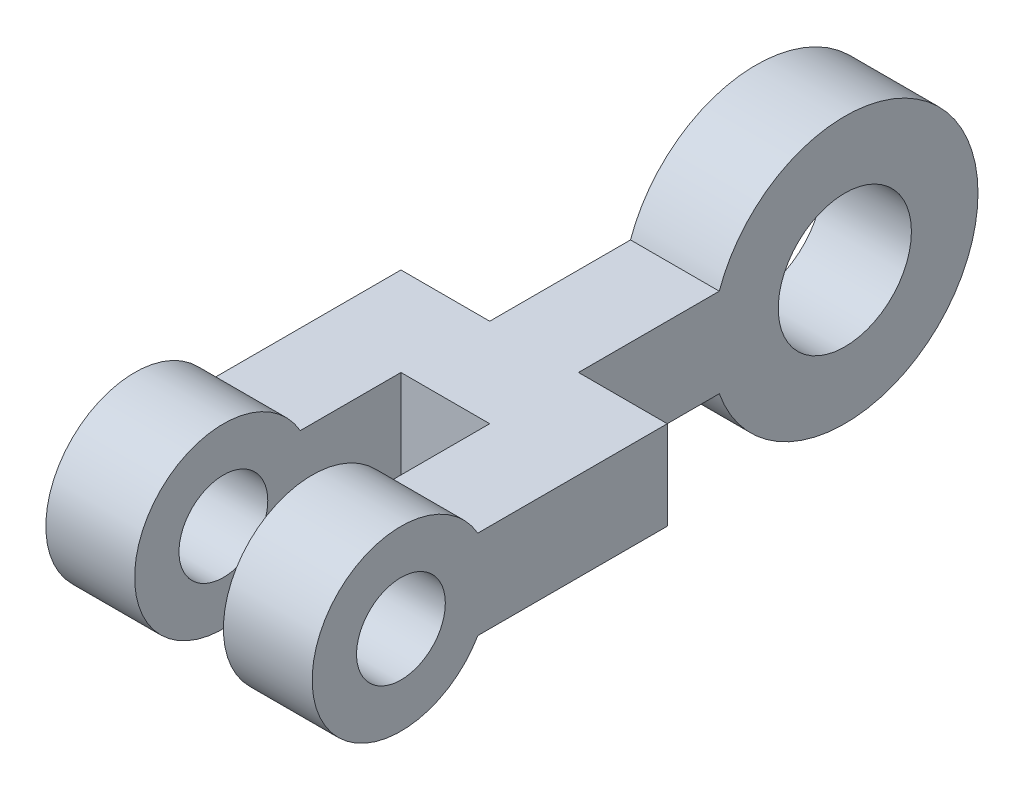
ISO-10303-21;
HEADER;
FILE_DESCRIPTION(('STEP AP214'),'2;1');
FILE_NAME('part.step','',(''),(''),'','','');
FILE_SCHEMA(('AUTOMOTIVE_DESIGN { 1 0 10303 214 1 1 1 1 }'));
ENDSEC;
DATA;
#1=APPLICATION_CONTEXT('core data for automotive mechanical design processes');
#2=APPLICATION_PROTOCOL_DEFINITION('international standard','automotive_design',2000,#1);
#3=PRODUCT_CONTEXT('',#1,'mechanical');
#4=PRODUCT('Part','Part','',(#3));
#5=PRODUCT_RELATED_PRODUCT_CATEGORY('part','',(#4));
#6=PRODUCT_DEFINITION_FORMATION('','',#4);
#7=PRODUCT_DEFINITION_CONTEXT('part definition',#1,'design');
#8=PRODUCT_DEFINITION('design','',#6,#7);
#9=PRODUCT_DEFINITION_SHAPE('','',#8);
#10=(LENGTH_UNIT() NAMED_UNIT(*) SI_UNIT(.MILLI.,.METRE.));
#11=(NAMED_UNIT(*) PLANE_ANGLE_UNIT() SI_UNIT($,.RADIAN.));
#12=(NAMED_UNIT(*) SI_UNIT($,.STERADIAN.) SOLID_ANGLE_UNIT());
#13=UNCERTAINTY_MEASURE_WITH_UNIT(LENGTH_MEASURE(1.E-05),#10,'distance_accuracy_value','');
#14=(GEOMETRIC_REPRESENTATION_CONTEXT(3) GLOBAL_UNCERTAINTY_ASSIGNED_CONTEXT((#13)) GLOBAL_UNIT_ASSIGNED_CONTEXT((#10,
#11,#12)) REPRESENTATION_CONTEXT('',''));
#15=CARTESIAN_POINT('',(0.,0.,0.));
#16=DIRECTION('',(0.,0.,1.));
#17=DIRECTION('',(1.,0.,0.));
#18=AXIS2_PLACEMENT_3D('',#15,#16,#17);
#19=CARTESIAN_POINT('',(19.05,6.34999999999999,0.));
#20=DIRECTION('',(0.,-1.,0.));
#21=DIRECTION('',(0.,0.,-1.));
#22=AXIS2_PLACEMENT_3D('',#19,#20,#21);
#23=PLANE('',#22);
#24=DIRECTION('',(0.,0.,1.));
#25=VECTOR('',#24,1.);
#26=CARTESIAN_POINT('',(6.35,6.34999999999999,0.));
#27=LINE('',#26,#25);
#28=CARTESIAN_POINT('',(6.35,6.35,-25.4));
#29=VERTEX_POINT('',#28);
#30=CARTESIAN_POINT('',(6.35,6.34999999999999,-10.9985226280624));
#31=VERTEX_POINT('',#30);
#32=EDGE_CURVE('E97',#29,#31,#27,.T.);
#33=ORIENTED_EDGE('',*,*,#32,.T.);
#34=DIRECTION('',(-1.,0.,0.));
#35=VECTOR('',#34,1.);
#36=CARTESIAN_POINT('',(19.05,6.34999999999999,-10.9985226280624));
#37=LINE('',#36,#35);
#38=CARTESIAN_POINT('',(19.05,6.34999999999999,-10.9985226280624));
#39=VERTEX_POINT('',#38);
#40=EDGE_CURVE('E11',#39,#31,#37,.T.);
#41=ORIENTED_EDGE('',*,*,#40,.F.);
#42=DIRECTION('',(0.,0.,1.));
#43=VECTOR('',#42,1.);
#44=CARTESIAN_POINT('',(19.05,6.34999999999999,0.));
#45=LINE('',#44,#43);
#46=CARTESIAN_POINT('',(19.05,6.35,-38.1));
#47=VERTEX_POINT('',#46);
#48=EDGE_CURVE('E101',#47,#39,#45,.T.);
#49=ORIENTED_EDGE('',*,*,#48,.F.);
#50=DIRECTION('',(-1.,0.,0.));
#51=VECTOR('',#50,1.);
#52=CARTESIAN_POINT('',(19.05,6.35,-38.1));
#53=LINE('',#52,#51);
#54=CARTESIAN_POINT('',(6.35,6.35,-38.1));
#55=VERTEX_POINT('',#54);
#56=EDGE_CURVE('E210',#47,#55,#53,.T.);
#57=ORIENTED_EDGE('',*,*,#56,.T.);
#58=DIRECTION('',(0.,0.,1.));
#59=VECTOR('',#58,1.);
#60=CARTESIAN_POINT('',(6.35,6.34999999999999,0.));
#61=LINE('',#60,#59);
#62=CARTESIAN_POINT('',(6.35,6.35,-58.2394877578617));
#63=VERTEX_POINT('',#62);
#64=EDGE_CURVE('E221',#63,#55,#61,.T.);
#65=ORIENTED_EDGE('',*,*,#64,.F.);
#66=DIRECTION('',(-1.,0.,0.));
#67=VECTOR('',#66,1.);
#68=CARTESIAN_POINT('',(6.35,6.35,-58.2394877578617));
#69=LINE('',#68,#67);
#70=CARTESIAN_POINT('',(-6.35,6.35,-58.2394877578617));
#71=VERTEX_POINT('',#70);
#72=EDGE_CURVE('E113',#63,#71,#69,.T.);
#73=ORIENTED_EDGE('',*,*,#72,.T.);
#74=DIRECTION('',(0.,0.,1.));
#75=VECTOR('',#74,1.);
#76=CARTESIAN_POINT('',(-6.35,6.34999999999999,0.));
#77=LINE('',#76,#75);
#78=CARTESIAN_POINT('',(-6.34999999999999,6.35,-38.1));
#79=VERTEX_POINT('',#78);
#80=EDGE_CURVE('E194',#71,#79,#77,.T.);
#81=ORIENTED_EDGE('',*,*,#80,.T.);
#82=CARTESIAN_POINT('',(-19.05,6.35,-38.1));
#83=VERTEX_POINT('',#82);
#84=EDGE_CURVE('E205',#79,#83,#53,.T.);
#85=ORIENTED_EDGE('',*,*,#84,.T.);
#86=DIRECTION('',(0.,0.,1.));
#87=VECTOR('',#86,1.);
#88=CARTESIAN_POINT('',(-19.05,6.34999999999999,0.));
#89=LINE('',#88,#87);
#90=CARTESIAN_POINT('',(-19.05,6.34999999999999,-10.9985226280624));
#91=VERTEX_POINT('',#90);
#92=EDGE_CURVE('E437',#83,#91,#89,.T.);
#93=ORIENTED_EDGE('',*,*,#92,.T.);
#94=DIRECTION('',(1.,0.,0.));
#95=VECTOR('',#94,1.);
#96=CARTESIAN_POINT('',(-19.05,6.34999999999999,-10.9985226280624));
#97=LINE('',#96,#95);
#98=CARTESIAN_POINT('',(-6.35,6.34999999999999,-10.9985226280624));
#99=VERTEX_POINT('',#98);
#100=EDGE_CURVE('E454',#91,#99,#97,.T.);
#101=ORIENTED_EDGE('',*,*,#100,.T.);
#102=DIRECTION('',(0.,0.,1.));
#103=VECTOR('',#102,1.);
#104=CARTESIAN_POINT('',(-6.35,6.34999999999999,0.));
#105=LINE('',#104,#103);
#106=CARTESIAN_POINT('',(-6.35,6.35,-25.4));
#107=VERTEX_POINT('',#106);
#108=EDGE_CURVE('E432',#107,#99,#105,.T.);
#109=ORIENTED_EDGE('',*,*,#108,.F.);
#110=DIRECTION('',(-1.,0.,0.));
#111=VECTOR('',#110,1.);
#112=CARTESIAN_POINT('',(19.05,6.35,-25.4));
#113=LINE('',#112,#111);
#114=EDGE_CURVE('E84',#29,#107,#113,.T.);
#115=ORIENTED_EDGE('',*,*,#114,.F.);
#116=EDGE_LOOP('',(#33,#41,#49,#57,#65,#73,#81,#85,#93,#101,#109,#115));
#117=FACE_BOUND('',#116,.T.);
#118=ADVANCED_FACE('F37',(#117),#23,.F.);
#119=CARTESIAN_POINT('',(19.05,0.,0.));
#120=DIRECTION('',(-1.,0.,0.));
#121=DIRECTION('',(0.,0.,1.));
#122=AXIS2_PLACEMENT_3D('',#119,#120,#121);
#123=CYLINDRICAL_SURFACE('',#122,12.7);
#124=CARTESIAN_POINT('',(6.35,0.,0.));
#125=DIRECTION('',(1.,0.,0.));
#126=DIRECTION('',(0.,0.,-1.));
#127=AXIS2_PLACEMENT_3D('',#124,#125,#126);
#128=CIRCLE('',#127,12.7);
#129=CARTESIAN_POINT('',(6.35,-6.34999999999999,-10.9985226280624));
#130=VERTEX_POINT('',#129);
#131=EDGE_CURVE('E64',#31,#130,#128,.T.);
#132=ORIENTED_EDGE('',*,*,#131,.T.);
#133=DIRECTION('',(-1.,0.,0.));
#134=VECTOR('',#133,1.);
#135=CARTESIAN_POINT('',(19.05,-6.34999999999999,-10.9985226280624));
#136=LINE('',#135,#134);
#137=CARTESIAN_POINT('',(19.05,-6.34999999999999,-10.9985226280624));
#138=VERTEX_POINT('',#137);
#139=EDGE_CURVE('E45',#138,#130,#136,.T.);
#140=ORIENTED_EDGE('',*,*,#139,.F.);
#141=CARTESIAN_POINT('',(19.05,0.,0.));
#142=DIRECTION('',(1.,0.,0.));
#143=DIRECTION('',(0.,0.,-1.));
#144=AXIS2_PLACEMENT_3D('',#141,#142,#143);
#145=CIRCLE('',#144,12.7);
#146=EDGE_CURVE('E53',#39,#138,#145,.T.);
#147=ORIENTED_EDGE('',*,*,#146,.F.);
#148=ORIENTED_EDGE('',*,*,#40,.T.);
#149=EDGE_LOOP('',(#132,#140,#147,#148));
#150=FACE_BOUND('',#149,.T.);
#151=ADVANCED_FACE('F138',(#150),#123,.T.);
#152=CARTESIAN_POINT('',(19.05,-6.34999999999999,0.));
#153=DIRECTION('',(0.,1.,0.));
#154=DIRECTION('',(0.,0.,1.));
#155=AXIS2_PLACEMENT_3D('',#152,#153,#154);
#156=PLANE('',#155);
#157=DIRECTION('',(0.,0.,-1.));
#158=VECTOR('',#157,1.);
#159=CARTESIAN_POINT('',(6.35,-6.34999999999999,0.));
#160=LINE('',#159,#158);
#161=CARTESIAN_POINT('',(6.35,-6.35,-25.4));
#162=VERTEX_POINT('',#161);
#163=EDGE_CURVE('E88',#130,#162,#160,.T.);
#164=ORIENTED_EDGE('',*,*,#163,.T.);
#165=DIRECTION('',(-1.,0.,0.));
#166=VECTOR('',#165,1.);
#167=CARTESIAN_POINT('',(19.05,-6.35,-25.4));
#168=LINE('',#167,#166);
#169=CARTESIAN_POINT('',(-6.34999999999999,-6.35,-25.4));
#170=VERTEX_POINT('',#169);
#171=EDGE_CURVE('E71',#162,#170,#168,.T.);
#172=ORIENTED_EDGE('',*,*,#171,.T.);
#173=DIRECTION('',(0.,0.,-1.));
#174=VECTOR('',#173,1.);
#175=CARTESIAN_POINT('',(-6.35,-6.34999999999999,0.));
#176=LINE('',#175,#174);
#177=CARTESIAN_POINT('',(-6.35,-6.34999999999999,-10.9985226280624));
#178=VERTEX_POINT('',#177);
#179=EDGE_CURVE('E461',#178,#170,#176,.T.);
#180=ORIENTED_EDGE('',*,*,#179,.F.);
#181=DIRECTION('',(1.,0.,0.));
#182=VECTOR('',#181,1.);
#183=CARTESIAN_POINT('',(-19.05,-6.34999999999999,-10.9985226280624));
#184=LINE('',#183,#182);
#185=CARTESIAN_POINT('',(-19.05,-6.34999999999999,-10.9985226280624));
#186=VERTEX_POINT('',#185);
#187=EDGE_CURVE('E463',#186,#178,#184,.T.);
#188=ORIENTED_EDGE('',*,*,#187,.F.);
#189=DIRECTION('',(0.,0.,-1.));
#190=VECTOR('',#189,1.);
#191=CARTESIAN_POINT('',(-19.05,-6.34999999999999,0.));
#192=LINE('',#191,#190);
#193=CARTESIAN_POINT('',(-19.05,-6.35,-38.1));
#194=VERTEX_POINT('',#193);
#195=EDGE_CURVE('E440',#186,#194,#192,.T.);
#196=ORIENTED_EDGE('',*,*,#195,.T.);
#197=DIRECTION('',(-1.,0.,0.));
#198=VECTOR('',#197,1.);
#199=CARTESIAN_POINT('',(19.05,-6.35,-38.1));
#200=LINE('',#199,#198);
#201=CARTESIAN_POINT('',(-6.34999999999999,-6.35,-38.1));
#202=VERTEX_POINT('',#201);
#203=EDGE_CURVE('E182',#202,#194,#200,.T.);
#204=ORIENTED_EDGE('',*,*,#203,.F.);
#205=DIRECTION('',(0.,0.,-1.));
#206=VECTOR('',#205,1.);
#207=CARTESIAN_POINT('',(-6.35,-6.34999999999999,0.));
#208=LINE('',#207,#206);
#209=CARTESIAN_POINT('',(-6.35,-6.35,-58.2394877578617));
#210=VERTEX_POINT('',#209);
#211=EDGE_CURVE('E179',#202,#210,#208,.T.);
#212=ORIENTED_EDGE('',*,*,#211,.T.);
#213=DIRECTION('',(-1.,0.,0.));
#214=VECTOR('',#213,1.);
#215=CARTESIAN_POINT('',(6.35,-6.35,-58.2394877578617));
#216=LINE('',#215,#214);
#217=CARTESIAN_POINT('',(6.35,-6.35,-58.2394877578617));
#218=VERTEX_POINT('',#217);
#219=EDGE_CURVE('E117',#218,#210,#216,.T.);
#220=ORIENTED_EDGE('',*,*,#219,.F.);
#221=DIRECTION('',(0.,0.,-1.));
#222=VECTOR('',#221,1.);
#223=CARTESIAN_POINT('',(6.35,-6.34999999999999,0.));
#224=LINE('',#223,#222);
#225=CARTESIAN_POINT('',(6.35,-6.35,-38.1));
#226=VERTEX_POINT('',#225);
#227=EDGE_CURVE('E125',#226,#218,#224,.T.);
#228=ORIENTED_EDGE('',*,*,#227,.F.);
#229=CARTESIAN_POINT('',(19.05,-6.35,-38.1));
#230=VERTEX_POINT('',#229);
#231=EDGE_CURVE('E85',#230,#226,#200,.T.);
#232=ORIENTED_EDGE('',*,*,#231,.F.);
#233=DIRECTION('',(0.,0.,-1.));
#234=VECTOR('',#233,1.);
#235=CARTESIAN_POINT('',(19.05,-6.34999999999999,0.));
#236=LINE('',#235,#234);
#237=EDGE_CURVE('E106',#138,#230,#236,.T.);
#238=ORIENTED_EDGE('',*,*,#237,.F.);
#239=ORIENTED_EDGE('',*,*,#139,.T.);
#240=EDGE_LOOP('',(#164,#172,#180,#188,#196,#204,#212,#220,#228,#232,#238,#239));
#241=FACE_BOUND('',#240,.T.);
#242=ADVANCED_FACE('F89',(#241),#156,.F.);
#243=CARTESIAN_POINT('',(19.05,0.,0.));
#244=DIRECTION('',(-1.,0.,0.));
#245=DIRECTION('',(0.,0.,1.));
#246=AXIS2_PLACEMENT_3D('',#243,#244,#245);
#247=CYLINDRICAL_SURFACE('',#246,6.35);
#248=CARTESIAN_POINT('',(19.05,0.,0.));
#249=DIRECTION('',(1.,0.,0.));
#250=DIRECTION('',(0.,0.,-1.));
#251=AXIS2_PLACEMENT_3D('',#248,#249,#250);
#252=CIRCLE('',#251,6.35);
#253=CARTESIAN_POINT('',(19.05,0.,-6.35));
#254=VERTEX_POINT('',#253);
#255=EDGE_CURVE('E104',#254,#254,#252,.T.);
#256=ORIENTED_EDGE('',*,*,#255,.T.);
#257=EDGE_LOOP('',(#256));
#258=FACE_BOUND('',#257,.T.);
#259=CARTESIAN_POINT('',(6.35,0.,0.));
#260=DIRECTION('',(1.,0.,0.));
#261=DIRECTION('',(0.,0.,-1.));
#262=AXIS2_PLACEMENT_3D('',#259,#260,#261);
#263=CIRCLE('',#262,6.35);
#264=CARTESIAN_POINT('',(6.35,0.,-6.35));
#265=VERTEX_POINT('',#264);
#266=EDGE_CURVE('E98',#265,#265,#263,.T.);
#267=ORIENTED_EDGE('',*,*,#266,.F.);
#268=EDGE_LOOP('',(#267));
#269=FACE_BOUND('',#268,.T.);
#270=ADVANCED_FACE('F248',(#258,#269),#247,.F.);
#271=CARTESIAN_POINT('',(19.05,0.,0.));
#272=DIRECTION('',(1.,0.,0.));
#273=DIRECTION('',(0.,0.,-1.));
#274=AXIS2_PLACEMENT_3D('',#271,#272,#273);
#275=PLANE('',#274);
#276=ORIENTED_EDGE('',*,*,#48,.T.);
#277=ORIENTED_EDGE('',*,*,#146,.T.);
#278=ORIENTED_EDGE('',*,*,#237,.T.);
#279=DIRECTION('',(0.,-1.,0.));
#280=VECTOR('',#279,1.);
#281=CARTESIAN_POINT('',(19.05,0.,-38.1));
#282=LINE('',#281,#280);
#283=EDGE_CURVE('E135',#47,#230,#282,.T.);
#284=ORIENTED_EDGE('',*,*,#283,.F.);
#285=EDGE_LOOP('',(#276,#277,#278,#284));
#286=FACE_BOUND('',#285,.T.);
#287=ORIENTED_EDGE('',*,*,#255,.F.);
#288=EDGE_LOOP('',(#287));
#289=FACE_BOUND('',#288,.T.);
#290=ADVANCED_FACE('F131',(#286,#289),#275,.T.);
#291=CARTESIAN_POINT('',(6.35,0.,0.));
#292=DIRECTION('',(1.,0.,0.));
#293=DIRECTION('',(0.,0.,-1.));
#294=AXIS2_PLACEMENT_3D('',#291,#292,#293);
#295=PLANE('',#294);
#296=ORIENTED_EDGE('',*,*,#32,.F.);
#297=DIRECTION('',(0.,-1.,0.));
#298=VECTOR('',#297,1.);
#299=CARTESIAN_POINT('',(6.35,0.,-25.4));
#300=LINE('',#299,#298);
#301=EDGE_CURVE('E76',#29,#162,#300,.T.);
#302=ORIENTED_EDGE('',*,*,#301,.T.);
#303=ORIENTED_EDGE('',*,*,#163,.F.);
#304=ORIENTED_EDGE('',*,*,#131,.F.);
#305=EDGE_LOOP('',(#296,#302,#303,#304));
#306=FACE_BOUND('',#305,.T.);
#307=ORIENTED_EDGE('',*,*,#266,.T.);
#308=EDGE_LOOP('',(#307));
#309=FACE_BOUND('',#308,.T.);
#310=ADVANCED_FACE('F94',(#306,#309),#295,.F.);
#311=CARTESIAN_POINT('',(19.05,0.,-25.4));
#312=DIRECTION('',(0.,0.,-1.));
#313=DIRECTION('',(-1.,0.,0.));
#314=AXIS2_PLACEMENT_3D('',#311,#312,#313);
#315=PLANE('',#314);
#316=ORIENTED_EDGE('',*,*,#171,.F.);
#317=ORIENTED_EDGE('',*,*,#301,.F.);
#318=ORIENTED_EDGE('',*,*,#114,.T.);
#319=DIRECTION('',(0.,-1.,0.));
#320=VECTOR('',#319,1.);
#321=CARTESIAN_POINT('',(-6.35,0.,-25.4));
#322=LINE('',#321,#320);
#323=EDGE_CURVE('E80',#107,#170,#322,.T.);
#324=ORIENTED_EDGE('',*,*,#323,.T.);
#325=EDGE_LOOP('',(#316,#317,#318,#324));
#326=FACE_BOUND('',#325,.T.);
#327=ADVANCED_FACE('F73',(#326),#315,.F.);
#328=CARTESIAN_POINT('',(6.35,0.,-76.2));
#329=DIRECTION('',(-1.,0.,0.));
#330=DIRECTION('',(0.,0.,1.));
#331=AXIS2_PLACEMENT_3D('',#328,#329,#330);
#332=CYLINDRICAL_SURFACE('',#331,19.05);
#333=CARTESIAN_POINT('',(-6.35,0.,-76.2));
#334=DIRECTION('',(1.,0.,0.));
#335=DIRECTION('',(0.,0.,-1.));
#336=AXIS2_PLACEMENT_3D('',#333,#334,#335);
#337=CIRCLE('',#336,19.05);
#338=EDGE_CURVE('E190',#210,#71,#337,.T.);
#339=ORIENTED_EDGE('',*,*,#338,.T.);
#340=ORIENTED_EDGE('',*,*,#72,.F.);
#341=CARTESIAN_POINT('',(6.35,0.,-76.2));
#342=DIRECTION('',(1.,0.,0.));
#343=DIRECTION('',(0.,0.,-1.));
#344=AXIS2_PLACEMENT_3D('',#341,#342,#343);
#345=CIRCLE('',#344,19.05);
#346=EDGE_CURVE('E192',#218,#63,#345,.T.);
#347=ORIENTED_EDGE('',*,*,#346,.F.);
#348=ORIENTED_EDGE('',*,*,#219,.T.);
#349=EDGE_LOOP('',(#339,#340,#347,#348));
#350=FACE_BOUND('',#349,.T.);
#351=ADVANCED_FACE('F189',(#350),#332,.T.);
#352=CARTESIAN_POINT('',(6.35,0.,-76.2));
#353=DIRECTION('',(-1.,0.,0.));
#354=DIRECTION('',(0.,0.,1.));
#355=AXIS2_PLACEMENT_3D('',#352,#353,#354);
#356=CYLINDRICAL_SURFACE('',#355,9.52500000000001);
#357=CARTESIAN_POINT('',(6.35,0.,-76.2));
#358=DIRECTION('',(1.,0.,0.));
#359=DIRECTION('',(0.,0.,-1.));
#360=AXIS2_PLACEMENT_3D('',#357,#358,#359);
#361=CIRCLE('',#360,9.52500000000001);
#362=CARTESIAN_POINT('',(6.35,0.,-85.725));
#363=VERTEX_POINT('',#362);
#364=EDGE_CURVE('E186',#363,#363,#361,.T.);
#365=ORIENTED_EDGE('',*,*,#364,.T.);
#366=EDGE_LOOP('',(#365));
#367=FACE_BOUND('',#366,.T.);
#368=CARTESIAN_POINT('',(-6.35,0.,-76.2));
#369=DIRECTION('',(1.,0.,0.));
#370=DIRECTION('',(0.,0.,-1.));
#371=AXIS2_PLACEMENT_3D('',#368,#369,#370);
#372=CIRCLE('',#371,9.52500000000001);
#373=CARTESIAN_POINT('',(-6.35,0.,-85.725));
#374=VERTEX_POINT('',#373);
#375=EDGE_CURVE('E195',#374,#374,#372,.T.);
#376=ORIENTED_EDGE('',*,*,#375,.F.);
#377=EDGE_LOOP('',(#376));
#378=FACE_BOUND('',#377,.T.);
#379=ADVANCED_FACE('F257',(#367,#378),#356,.F.);
#380=CARTESIAN_POINT('',(6.35,0.,0.));
#381=DIRECTION('',(1.,0.,0.));
#382=DIRECTION('',(0.,0.,-1.));
#383=AXIS2_PLACEMENT_3D('',#380,#381,#382);
#384=PLANE('',#383);
#385=ORIENTED_EDGE('',*,*,#364,.F.);
#386=EDGE_LOOP('',(#385));
#387=FACE_BOUND('',#386,.T.);
#388=ORIENTED_EDGE('',*,*,#346,.T.);
#389=ORIENTED_EDGE('',*,*,#64,.T.);
#390=DIRECTION('',(0.,-1.,0.));
#391=VECTOR('',#390,1.);
#392=CARTESIAN_POINT('',(6.35,0.,-38.1));
#393=LINE('',#392,#391);
#394=EDGE_CURVE('E224',#55,#226,#393,.T.);
#395=ORIENTED_EDGE('',*,*,#394,.T.);
#396=ORIENTED_EDGE('',*,*,#227,.T.);
#397=EDGE_LOOP('',(#388,#389,#395,#396));
#398=FACE_BOUND('',#397,.T.);
#399=ADVANCED_FACE('F227',(#387,#398),#384,.T.);
#400=CARTESIAN_POINT('',(-6.35,0.,0.));
#401=DIRECTION('',(1.,0.,0.));
#402=DIRECTION('',(0.,0.,-1.));
#403=AXIS2_PLACEMENT_3D('',#400,#401,#402);
#404=PLANE('',#403);
#405=ORIENTED_EDGE('',*,*,#375,.T.);
#406=EDGE_LOOP('',(#405));
#407=FACE_BOUND('',#406,.T.);
#408=ORIENTED_EDGE('',*,*,#338,.F.);
#409=ORIENTED_EDGE('',*,*,#211,.F.);
#410=DIRECTION('',(0.,-1.,0.));
#411=VECTOR('',#410,1.);
#412=CARTESIAN_POINT('',(-6.35,0.,-38.1));
#413=LINE('',#412,#411);
#414=EDGE_CURVE('E187',#79,#202,#413,.T.);
#415=ORIENTED_EDGE('',*,*,#414,.F.);
#416=ORIENTED_EDGE('',*,*,#80,.F.);
#417=EDGE_LOOP('',(#408,#409,#415,#416));
#418=FACE_BOUND('',#417,.T.);
#419=ADVANCED_FACE('F193',(#407,#418),#404,.F.);
#420=CARTESIAN_POINT('',(19.05,0.,-38.1));
#421=DIRECTION('',(0.,0.,-1.));
#422=DIRECTION('',(-1.,0.,0.));
#423=AXIS2_PLACEMENT_3D('',#420,#421,#422);
#424=PLANE('',#423);
#425=ORIENTED_EDGE('',*,*,#394,.F.);
#426=ORIENTED_EDGE('',*,*,#56,.F.);
#427=ORIENTED_EDGE('',*,*,#283,.T.);
#428=ORIENTED_EDGE('',*,*,#231,.T.);
#429=EDGE_LOOP('',(#425,#426,#427,#428));
#430=FACE_BOUND('',#429,.T.);
#431=ADVANCED_FACE('F229',(#430),#424,.T.);
#432=ORIENTED_EDGE('',*,*,#84,.F.);
#433=ORIENTED_EDGE('',*,*,#414,.T.);
#434=ORIENTED_EDGE('',*,*,#203,.T.);
#435=DIRECTION('',(0.,-1.,0.));
#436=VECTOR('',#435,1.);
#437=CARTESIAN_POINT('',(-19.05,0.,-38.1));
#438=LINE('',#437,#436);
#439=EDGE_CURVE('E207',#83,#194,#438,.T.);
#440=ORIENTED_EDGE('',*,*,#439,.F.);
#441=EDGE_LOOP('',(#432,#433,#434,#440));
#442=FACE_BOUND('',#441,.T.);
#443=ADVANCED_FACE('F203',(#442),#424,.T.);
#444=CARTESIAN_POINT('',(-19.05,0.,0.));
#445=DIRECTION('',(1.,0.,0.));
#446=DIRECTION('',(0.,0.,-1.));
#447=AXIS2_PLACEMENT_3D('',#444,#445,#446);
#448=PLANE('',#447);
#449=ORIENTED_EDGE('',*,*,#92,.F.);
#450=ORIENTED_EDGE('',*,*,#439,.T.);
#451=ORIENTED_EDGE('',*,*,#195,.F.);
#452=CARTESIAN_POINT('',(-19.05,0.,0.));
#453=DIRECTION('',(1.,0.,0.));
#454=DIRECTION('',(0.,0.,-1.));
#455=AXIS2_PLACEMENT_3D('',#452,#453,#454);
#456=CIRCLE('',#455,12.7);
#457=EDGE_CURVE('E451',#91,#186,#456,.T.);
#458=ORIENTED_EDGE('',*,*,#457,.F.);
#459=EDGE_LOOP('',(#449,#450,#451,#458));
#460=FACE_BOUND('',#459,.T.);
#461=CARTESIAN_POINT('',(-19.05,0.,0.));
#462=DIRECTION('',(1.,0.,0.));
#463=DIRECTION('',(0.,0.,-1.));
#464=AXIS2_PLACEMENT_3D('',#461,#462,#463);
#465=CIRCLE('',#464,6.35);
#466=CARTESIAN_POINT('',(-19.05,0.,-6.35));
#467=VERTEX_POINT('',#466);
#468=EDGE_CURVE('E438',#467,#467,#465,.T.);
#469=ORIENTED_EDGE('',*,*,#468,.T.);
#470=EDGE_LOOP('',(#469));
#471=FACE_BOUND('',#470,.T.);
#472=ADVANCED_FACE('F236',(#460,#471),#448,.F.);
#473=CARTESIAN_POINT('',(-19.05,0.,0.));
#474=DIRECTION('',(1.,0.,0.));
#475=DIRECTION('',(0.,0.,1.));
#476=AXIS2_PLACEMENT_3D('',#473,#474,#475);
#477=CYLINDRICAL_SURFACE('',#476,12.7);
#478=CARTESIAN_POINT('',(-6.35,0.,0.));
#479=DIRECTION('',(1.,0.,0.));
#480=DIRECTION('',(0.,0.,-1.));
#481=AXIS2_PLACEMENT_3D('',#478,#479,#480);
#482=CIRCLE('',#481,12.7);
#483=EDGE_CURVE('E465',#99,#178,#482,.T.);
#484=ORIENTED_EDGE('',*,*,#483,.F.);
#485=ORIENTED_EDGE('',*,*,#100,.F.);
#486=ORIENTED_EDGE('',*,*,#457,.T.);
#487=ORIENTED_EDGE('',*,*,#187,.T.);
#488=EDGE_LOOP('',(#484,#485,#486,#487));
#489=FACE_BOUND('',#488,.T.);
#490=ADVANCED_FACE('F297',(#489),#477,.T.);
#491=CARTESIAN_POINT('',(-19.05,0.,0.));
#492=DIRECTION('',(1.,0.,0.));
#493=DIRECTION('',(0.,0.,1.));
#494=AXIS2_PLACEMENT_3D('',#491,#492,#493);
#495=CYLINDRICAL_SURFACE('',#494,6.35);
#496=ORIENTED_EDGE('',*,*,#468,.F.);
#497=EDGE_LOOP('',(#496));
#498=FACE_BOUND('',#497,.T.);
#499=CARTESIAN_POINT('',(-6.35,0.,0.));
#500=DIRECTION('',(1.,0.,0.));
#501=DIRECTION('',(0.,0.,-1.));
#502=AXIS2_PLACEMENT_3D('',#499,#500,#501);
#503=CIRCLE('',#502,6.35);
#504=CARTESIAN_POINT('',(-6.35,0.,-6.35));
#505=VERTEX_POINT('',#504);
#506=EDGE_CURVE('E435',#505,#505,#503,.T.);
#507=ORIENTED_EDGE('',*,*,#506,.T.);
#508=EDGE_LOOP('',(#507));
#509=FACE_BOUND('',#508,.T.);
#510=ADVANCED_FACE('F305',(#498,#509),#495,.F.);
#511=CARTESIAN_POINT('',(-6.35,0.,0.));
#512=DIRECTION('',(-1.,0.,0.));
#513=DIRECTION('',(0.,0.,-1.));
#514=AXIS2_PLACEMENT_3D('',#511,#512,#513);
#515=PLANE('',#514);
#516=ORIENTED_EDGE('',*,*,#108,.T.);
#517=ORIENTED_EDGE('',*,*,#483,.T.);
#518=ORIENTED_EDGE('',*,*,#179,.T.);
#519=ORIENTED_EDGE('',*,*,#323,.F.);
#520=EDGE_LOOP('',(#516,#517,#518,#519));
#521=FACE_BOUND('',#520,.T.);
#522=ORIENTED_EDGE('',*,*,#506,.F.);
#523=EDGE_LOOP('',(#522));
#524=FACE_BOUND('',#523,.T.);
#525=ADVANCED_FACE('F314',(#521,#524),#515,.F.);
#526=CLOSED_SHELL('',(#118,#151,#242,#270,#290,#310,#327,#351,#379,#399,#419,#431,#443,#472,
#490,#510,#525));
#527=MANIFOLD_SOLID_BREP('B2',#526);
#528=ADVANCED_BREP_SHAPE_REPRESENTATION('',(#18,#527),#14);
#529=SHAPE_DEFINITION_REPRESENTATION(#9,#528);
ENDSEC;
END-ISO-10303-21;
